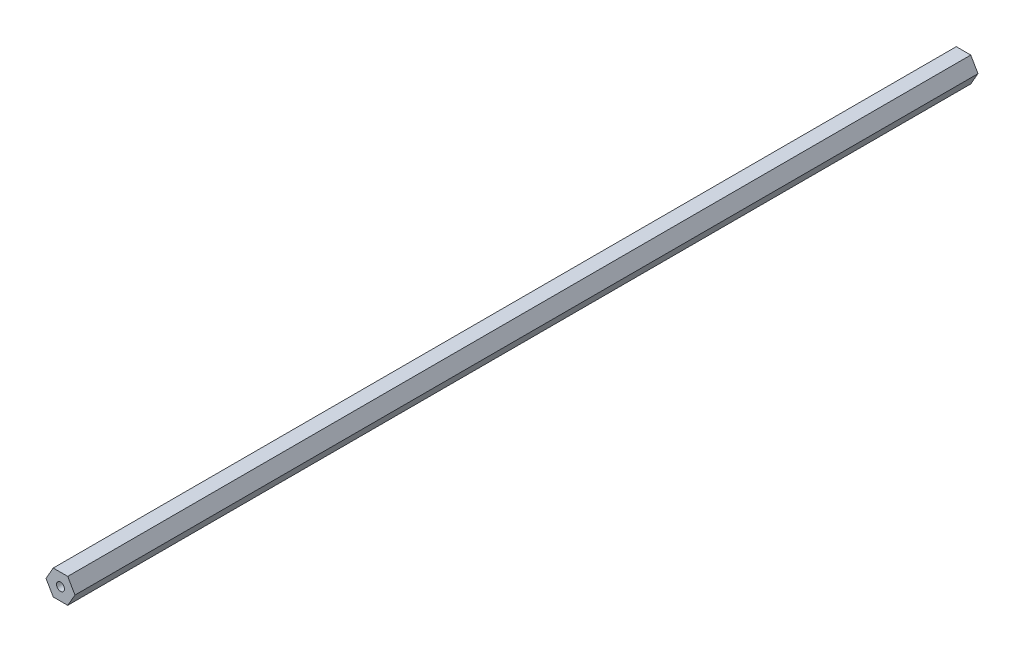
ISO-10303-21;
HEADER;
FILE_DESCRIPTION(('STEP AP214'),'2;1');
FILE_NAME('part.step','',(''),(''),'','','');
FILE_SCHEMA(('AUTOMOTIVE_DESIGN { 1 0 10303 214 1 1 1 1 }'));
ENDSEC;
DATA;
#1=APPLICATION_CONTEXT('core data for automotive mechanical design processes');
#2=APPLICATION_PROTOCOL_DEFINITION('international standard','automotive_design',2000,#1);
#3=PRODUCT_CONTEXT('',#1,'mechanical');
#4=PRODUCT('Part','Part','',(#3));
#5=PRODUCT_RELATED_PRODUCT_CATEGORY('part','',(#4));
#6=PRODUCT_DEFINITION_FORMATION('','',#4);
#7=PRODUCT_DEFINITION_CONTEXT('part definition',#1,'design');
#8=PRODUCT_DEFINITION('design','',#6,#7);
#9=PRODUCT_DEFINITION_SHAPE('','',#8);
#10=(LENGTH_UNIT() NAMED_UNIT(*) SI_UNIT(.MILLI.,.METRE.));
#11=(NAMED_UNIT(*) PLANE_ANGLE_UNIT() SI_UNIT($,.RADIAN.));
#12=(NAMED_UNIT(*) SI_UNIT($,.STERADIAN.) SOLID_ANGLE_UNIT());
#13=UNCERTAINTY_MEASURE_WITH_UNIT(LENGTH_MEASURE(1.E-05),#10,'distance_accuracy_value','');
#14=(GEOMETRIC_REPRESENTATION_CONTEXT(3) GLOBAL_UNCERTAINTY_ASSIGNED_CONTEXT((#13)) GLOBAL_UNIT_ASSIGNED_CONTEXT((#10,
#11,#12)) REPRESENTATION_CONTEXT('',''));
#15=CARTESIAN_POINT('',(0.,0.,0.));
#16=DIRECTION('',(0.,0.,1.));
#17=DIRECTION('',(1.,0.,0.));
#18=AXIS2_PLACEMENT_3D('',#15,#16,#17);
#19=CARTESIAN_POINT('',(0.,0.,0.));
#20=DIRECTION('',(0.,0.,1.));
#21=DIRECTION('',(1.,0.,0.));
#22=AXIS2_PLACEMENT_3D('',#19,#20,#21);
#23=PLANE('',#22);
#24=CARTESIAN_POINT('',(0.,0.,0.));
#25=DIRECTION('',(0.,0.,-1.));
#26=DIRECTION('',(-1.,0.,0.));
#27=AXIS2_PLACEMENT_3D('',#24,#25,#26);
#28=CIRCLE('',#27,2.0193);
#29=CARTESIAN_POINT('',(2.0193,0.,0.));
#30=VERTEX_POINT('',#29);
#31=EDGE_CURVE('E221',#30,#30,#28,.T.);
#32=ORIENTED_EDGE('',*,*,#31,.F.);
#33=EDGE_LOOP('',(#32));
#34=FACE_BOUND('',#33,.T.);
#35=DIRECTION('',(-0.5,-0.866025403784438,0.));
#36=VECTOR('',#35,1.);
#37=CARTESIAN_POINT('',(-3.66617420935411,6.35,0.));
#38=LINE('',#37,#36);
#39=CARTESIAN_POINT('',(-3.66617420935411,6.35,0.));
#40=VERTEX_POINT('',#39);
#41=CARTESIAN_POINT('',(-7.33234841870825,0.,0.));
#42=VERTEX_POINT('',#41);
#43=EDGE_CURVE('E26',#40,#42,#38,.T.);
#44=ORIENTED_EDGE('',*,*,#43,.F.);
#45=DIRECTION('',(-1.,0.,0.));
#46=VECTOR('',#45,1.);
#47=CARTESIAN_POINT('',(3.66617420935411,6.35,0.));
#48=LINE('',#47,#46);
#49=CARTESIAN_POINT('',(3.66617420935411,6.35,0.));
#50=VERTEX_POINT('',#49);
#51=EDGE_CURVE('E215',#50,#40,#48,.T.);
#52=ORIENTED_EDGE('',*,*,#51,.F.);
#53=DIRECTION('',(-0.5,0.866025403784439,0.));
#54=VECTOR('',#53,1.);
#55=CARTESIAN_POINT('',(7.33234841870825,0.,0.));
#56=LINE('',#55,#54);
#57=CARTESIAN_POINT('',(7.33234841870825,0.,0.));
#58=VERTEX_POINT('',#57);
#59=EDGE_CURVE('E119',#58,#50,#56,.T.);
#60=ORIENTED_EDGE('',*,*,#59,.F.);
#61=DIRECTION('',(0.5,0.866025403784438,0.));
#62=VECTOR('',#61,1.);
#63=CARTESIAN_POINT('',(3.66617420935411,-6.35,0.));
#64=LINE('',#63,#62);
#65=CARTESIAN_POINT('',(3.66617420935411,-6.35,0.));
#66=VERTEX_POINT('',#65);
#67=EDGE_CURVE('E112',#66,#58,#64,.T.);
#68=ORIENTED_EDGE('',*,*,#67,.F.);
#69=DIRECTION('',(1.,0.,0.));
#70=VECTOR('',#69,1.);
#71=CARTESIAN_POINT('',(-3.66617420935414,-6.35,0.));
#72=LINE('',#71,#70);
#73=CARTESIAN_POINT('',(-3.66617420935414,-6.35,0.));
#74=VERTEX_POINT('',#73);
#75=EDGE_CURVE('E95',#74,#66,#72,.T.);
#76=ORIENTED_EDGE('',*,*,#75,.F.);
#77=DIRECTION('',(0.5,-0.866025403784439,0.));
#78=VECTOR('',#77,1.);
#79=CARTESIAN_POINT('',(-7.33234841870825,0.,0.));
#80=LINE('',#79,#78);
#81=EDGE_CURVE('E136',#42,#74,#80,.T.);
#82=ORIENTED_EDGE('',*,*,#81,.F.);
#83=EDGE_LOOP('',(#44,#52,#60,#68,#76,#82));
#84=FACE_BOUND('',#83,.T.);
#85=ADVANCED_FACE('F17',(#34,#84),#23,.F.);
#86=CARTESIAN_POINT('',(0.,0.,457.2));
#87=DIRECTION('',(0.,0.,1.));
#88=DIRECTION('',(1.,0.,0.));
#89=AXIS2_PLACEMENT_3D('',#86,#87,#88);
#90=PLANE('',#89);
#91=CARTESIAN_POINT('',(0.,0.,457.2));
#92=DIRECTION('',(0.,0.,-1.));
#93=DIRECTION('',(-1.,0.,0.));
#94=AXIS2_PLACEMENT_3D('',#91,#92,#93);
#95=CIRCLE('',#94,2.0193);
#96=CARTESIAN_POINT('',(2.0193,0.,457.2));
#97=VERTEX_POINT('',#96);
#98=EDGE_CURVE('E232',#97,#97,#95,.T.);
#99=ORIENTED_EDGE('',*,*,#98,.T.);
#100=EDGE_LOOP('',(#99));
#101=FACE_BOUND('',#100,.T.);
#102=DIRECTION('',(-0.5,-0.866025403784438,0.));
#103=VECTOR('',#102,1.);
#104=CARTESIAN_POINT('',(-3.66617420935411,6.35,457.2));
#105=LINE('',#104,#103);
#106=CARTESIAN_POINT('',(-3.66617420935411,6.35,457.2));
#107=VERTEX_POINT('',#106);
#108=CARTESIAN_POINT('',(-7.33234841870825,0.,457.2));
#109=VERTEX_POINT('',#108);
#110=EDGE_CURVE('E11',#107,#109,#105,.T.);
#111=ORIENTED_EDGE('',*,*,#110,.T.);
#112=DIRECTION('',(0.5,-0.866025403784439,0.));
#113=VECTOR('',#112,1.);
#114=CARTESIAN_POINT('',(-7.33234841870825,0.,457.2));
#115=LINE('',#114,#113);
#116=CARTESIAN_POINT('',(-3.66617420935414,-6.35,457.2));
#117=VERTEX_POINT('',#116);
#118=EDGE_CURVE('E139',#109,#117,#115,.T.);
#119=ORIENTED_EDGE('',*,*,#118,.T.);
#120=DIRECTION('',(1.,0.,0.));
#121=VECTOR('',#120,1.);
#122=CARTESIAN_POINT('',(-3.66617420935414,-6.35,457.2));
#123=LINE('',#122,#121);
#124=CARTESIAN_POINT('',(3.66617420935411,-6.35,457.2));
#125=VERTEX_POINT('',#124);
#126=EDGE_CURVE('E107',#117,#125,#123,.T.);
#127=ORIENTED_EDGE('',*,*,#126,.T.);
#128=DIRECTION('',(0.5,0.866025403784438,0.));
#129=VECTOR('',#128,1.);
#130=CARTESIAN_POINT('',(3.66617420935411,-6.35,457.2));
#131=LINE('',#130,#129);
#132=CARTESIAN_POINT('',(7.33234841870825,0.,457.2));
#133=VERTEX_POINT('',#132);
#134=EDGE_CURVE('E114',#125,#133,#131,.T.);
#135=ORIENTED_EDGE('',*,*,#134,.T.);
#136=DIRECTION('',(-0.5,0.866025403784439,0.));
#137=VECTOR('',#136,1.);
#138=CARTESIAN_POINT('',(7.33234841870825,0.,457.2));
#139=LINE('',#138,#137);
#140=CARTESIAN_POINT('',(3.66617420935411,6.35,457.2));
#141=VERTEX_POINT('',#140);
#142=EDGE_CURVE('E129',#133,#141,#139,.T.);
#143=ORIENTED_EDGE('',*,*,#142,.T.);
#144=DIRECTION('',(-1.,0.,0.));
#145=VECTOR('',#144,1.);
#146=CARTESIAN_POINT('',(3.66617420935411,6.35,457.2));
#147=LINE('',#146,#145);
#148=EDGE_CURVE('E203',#141,#107,#147,.T.);
#149=ORIENTED_EDGE('',*,*,#148,.T.);
#150=EDGE_LOOP('',(#111,#119,#127,#135,#143,#149));
#151=FACE_BOUND('',#150,.T.);
#152=ADVANCED_FACE('F241',(#101,#151),#90,.T.);
#153=CARTESIAN_POINT('',(-3.66617420935411,6.35,0.));
#154=DIRECTION('',(-0.866025403784439,0.5,0.));
#155=DIRECTION('',(0.,0.,1.));
#156=AXIS2_PLACEMENT_3D('',#153,#154,#155);
#157=PLANE('',#156);
#158=ORIENTED_EDGE('',*,*,#43,.T.);
#159=DIRECTION('',(0.,0.,1.));
#160=VECTOR('',#159,1.);
#161=CARTESIAN_POINT('',(-7.33234841870825,0.,0.));
#162=LINE('',#161,#160);
#163=EDGE_CURVE('E142',#42,#109,#162,.T.);
#164=ORIENTED_EDGE('',*,*,#163,.T.);
#165=ORIENTED_EDGE('',*,*,#110,.F.);
#166=DIRECTION('',(0.,0.,1.));
#167=VECTOR('',#166,1.);
#168=CARTESIAN_POINT('',(-3.66617420935411,6.35,0.));
#169=LINE('',#168,#167);
#170=EDGE_CURVE('E207',#40,#107,#169,.T.);
#171=ORIENTED_EDGE('',*,*,#170,.F.);
#172=EDGE_LOOP('',(#158,#164,#165,#171));
#173=FACE_BOUND('',#172,.T.);
#174=ADVANCED_FACE('F253',(#173),#157,.T.);
#175=CARTESIAN_POINT('',(-7.33234841870825,0.,0.));
#176=DIRECTION('',(-0.866025403784439,-0.5,0.));
#177=DIRECTION('',(-0.5,0.866025403784439,0.));
#178=AXIS2_PLACEMENT_3D('',#175,#176,#177);
#179=PLANE('',#178);
#180=ORIENTED_EDGE('',*,*,#81,.T.);
#181=DIRECTION('',(0.,0.,1.));
#182=VECTOR('',#181,1.);
#183=CARTESIAN_POINT('',(-3.66617420935414,-6.35,0.));
#184=LINE('',#183,#182);
#185=EDGE_CURVE('E102',#74,#117,#184,.T.);
#186=ORIENTED_EDGE('',*,*,#185,.T.);
#187=ORIENTED_EDGE('',*,*,#118,.F.);
#188=ORIENTED_EDGE('',*,*,#163,.F.);
#189=EDGE_LOOP('',(#180,#186,#187,#188));
#190=FACE_BOUND('',#189,.T.);
#191=ADVANCED_FACE('F19',(#190),#179,.T.);
#192=CARTESIAN_POINT('',(-3.66617420935414,-6.35,0.));
#193=DIRECTION('',(0.,-1.,0.));
#194=DIRECTION('',(-1.,0.,0.));
#195=AXIS2_PLACEMENT_3D('',#192,#193,#194);
#196=PLANE('',#195);
#197=ORIENTED_EDGE('',*,*,#75,.T.);
#198=DIRECTION('',(0.,0.,1.));
#199=VECTOR('',#198,1.);
#200=CARTESIAN_POINT('',(3.66617420935411,-6.35,0.));
#201=LINE('',#200,#199);
#202=EDGE_CURVE('E99',#66,#125,#201,.T.);
#203=ORIENTED_EDGE('',*,*,#202,.T.);
#204=ORIENTED_EDGE('',*,*,#126,.F.);
#205=ORIENTED_EDGE('',*,*,#185,.F.);
#206=EDGE_LOOP('',(#197,#203,#204,#205));
#207=FACE_BOUND('',#206,.T.);
#208=ADVANCED_FACE('F97',(#207),#196,.T.);
#209=CARTESIAN_POINT('',(3.66617420935411,-6.35,0.));
#210=DIRECTION('',(0.866025403784439,-0.5,0.));
#211=DIRECTION('',(0.,0.,-1.));
#212=AXIS2_PLACEMENT_3D('',#209,#210,#211);
#213=PLANE('',#212);
#214=ORIENTED_EDGE('',*,*,#67,.T.);
#215=DIRECTION('',(0.,0.,1.));
#216=VECTOR('',#215,1.);
#217=CARTESIAN_POINT('',(7.33234841870825,0.,0.));
#218=LINE('',#217,#216);
#219=EDGE_CURVE('E121',#58,#133,#218,.T.);
#220=ORIENTED_EDGE('',*,*,#219,.T.);
#221=ORIENTED_EDGE('',*,*,#134,.F.);
#222=ORIENTED_EDGE('',*,*,#202,.F.);
#223=EDGE_LOOP('',(#214,#220,#221,#222));
#224=FACE_BOUND('',#223,.T.);
#225=ADVANCED_FACE('F110',(#224),#213,.T.);
#226=CARTESIAN_POINT('',(7.33234841870825,0.,0.));
#227=DIRECTION('',(0.866025403784439,0.5,0.));
#228=DIRECTION('',(0.,0.,-1.));
#229=AXIS2_PLACEMENT_3D('',#226,#227,#228);
#230=PLANE('',#229);
#231=ORIENTED_EDGE('',*,*,#59,.T.);
#232=DIRECTION('',(0.,0.,1.));
#233=VECTOR('',#232,1.);
#234=CARTESIAN_POINT('',(3.66617420935411,6.35,0.));
#235=LINE('',#234,#233);
#236=EDGE_CURVE('E181',#50,#141,#235,.T.);
#237=ORIENTED_EDGE('',*,*,#236,.T.);
#238=ORIENTED_EDGE('',*,*,#142,.F.);
#239=ORIENTED_EDGE('',*,*,#219,.F.);
#240=EDGE_LOOP('',(#231,#237,#238,#239));
#241=FACE_BOUND('',#240,.T.);
#242=ADVANCED_FACE('F260',(#241),#230,.T.);
#243=CARTESIAN_POINT('',(3.66617420935411,6.35,0.));
#244=DIRECTION('',(0.,1.,0.));
#245=DIRECTION('',(1.,0.,0.));
#246=AXIS2_PLACEMENT_3D('',#243,#244,#245);
#247=PLANE('',#246);
#248=ORIENTED_EDGE('',*,*,#51,.T.);
#249=ORIENTED_EDGE('',*,*,#170,.T.);
#250=ORIENTED_EDGE('',*,*,#148,.F.);
#251=ORIENTED_EDGE('',*,*,#236,.F.);
#252=EDGE_LOOP('',(#248,#249,#250,#251));
#253=FACE_BOUND('',#252,.T.);
#254=ADVANCED_FACE('F257',(#253),#247,.T.);
#255=CARTESIAN_POINT('',(0.,0.,0.));
#256=DIRECTION('',(0.,0.,1.));
#257=DIRECTION('',(-1.,0.,0.));
#258=AXIS2_PLACEMENT_3D('',#255,#256,#257);
#259=CYLINDRICAL_SURFACE('',#258,2.0193);
#260=ORIENTED_EDGE('',*,*,#98,.F.);
#261=DIRECTION('',(0.,0.,-1.));
#262=VECTOR('',#261,1.);
#263=CARTESIAN_POINT('',(2.0193,0.,0.));
#264=LINE('',#263,#262);
#265=EDGE_CURVE('E226',#97,#30,#264,.T.);
#266=ORIENTED_EDGE('',*,*,#265,.T.);
#267=ORIENTED_EDGE('',*,*,#31,.T.);
#268=ORIENTED_EDGE('',*,*,#265,.F.);
#269=EDGE_LOOP('',(#260,#266,#267,#268));
#270=FACE_BOUND('',#269,.T.);
#271=ADVANCED_FACE('F243',(#270),#259,.F.);
#272=CLOSED_SHELL('',(#85,#152,#174,#191,#208,#225,#242,#254,#271));
#273=MANIFOLD_SOLID_BREP('B1',#272);
#274=ADVANCED_BREP_SHAPE_REPRESENTATION('',(#18,#273),#14);
#275=SHAPE_DEFINITION_REPRESENTATION(#9,#274);
ENDSEC;
END-ISO-10303-21;
